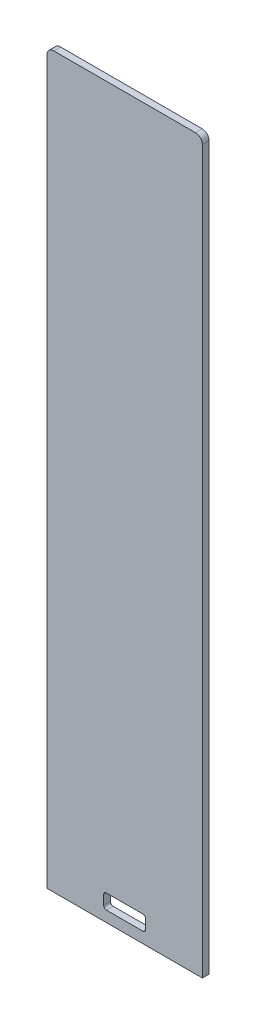
ISO-10303-21;
HEADER;
FILE_DESCRIPTION(('STEP AP214'),'2;1');
FILE_NAME('part.step','',(''),(''),'','','');
FILE_SCHEMA(('AUTOMOTIVE_DESIGN { 1 0 10303 214 1 1 1 1 }'));
ENDSEC;
DATA;
#1=APPLICATION_CONTEXT('core data for automotive mechanical design processes');
#2=APPLICATION_PROTOCOL_DEFINITION('international standard','automotive_design',2000,#1);
#3=PRODUCT_CONTEXT('',#1,'mechanical');
#4=PRODUCT('Part','Part','',(#3));
#5=PRODUCT_RELATED_PRODUCT_CATEGORY('part','',(#4));
#6=PRODUCT_DEFINITION_FORMATION('','',#4);
#7=PRODUCT_DEFINITION_CONTEXT('part definition',#1,'design');
#8=PRODUCT_DEFINITION('design','',#6,#7);
#9=PRODUCT_DEFINITION_SHAPE('','',#8);
#10=(LENGTH_UNIT() NAMED_UNIT(*) SI_UNIT(.MILLI.,.METRE.));
#11=(NAMED_UNIT(*) PLANE_ANGLE_UNIT() SI_UNIT($,.RADIAN.));
#12=(NAMED_UNIT(*) SI_UNIT($,.STERADIAN.) SOLID_ANGLE_UNIT());
#13=UNCERTAINTY_MEASURE_WITH_UNIT(LENGTH_MEASURE(1.E-05),#10,'distance_accuracy_value','');
#14=(GEOMETRIC_REPRESENTATION_CONTEXT(3) GLOBAL_UNCERTAINTY_ASSIGNED_CONTEXT((#13)) GLOBAL_UNIT_ASSIGNED_CONTEXT((#10,
#11,#12)) REPRESENTATION_CONTEXT('',''));
#15=CARTESIAN_POINT('',(0.,0.,0.));
#16=DIRECTION('',(0.,0.,1.));
#17=DIRECTION('',(1.,0.,0.));
#18=AXIS2_PLACEMENT_3D('',#15,#16,#17);
#19=CARTESIAN_POINT('',(-57.5,499.2,5.));
#20=DIRECTION('',(1.,0.,0.));
#21=DIRECTION('',(0.,1.,0.));
#22=AXIS2_PLACEMENT_3D('',#19,#20,#21);
#23=PLANE('',#22);
#24=DIRECTION('',(0.,-1.,0.));
#25=VECTOR('',#24,1.);
#26=CARTESIAN_POINT('',(-57.5,499.2,5.));
#27=LINE('',#26,#25);
#28=CARTESIAN_POINT('',(-57.5,534.2,5.));
#29=VERTEX_POINT('',#28);
#30=CARTESIAN_POINT('',(-57.5000000000001,0.,5.));
#31=VERTEX_POINT('',#30);
#32=EDGE_CURVE('E142',#29,#31,#27,.T.);
#33=ORIENTED_EDGE('',*,*,#32,.F.);
#34=DIRECTION('',(0.,0.,1.));
#35=VECTOR('',#34,1.);
#36=CARTESIAN_POINT('',(-57.5,534.2,0.));
#37=LINE('',#36,#35);
#38=CARTESIAN_POINT('',(-57.5,534.2,0.));
#39=VERTEX_POINT('',#38);
#40=EDGE_CURVE('E63',#29,#39,#37,.F.);
#41=ORIENTED_EDGE('',*,*,#40,.T.);
#42=DIRECTION('',(0.,-1.,0.));
#43=VECTOR('',#42,1.);
#44=CARTESIAN_POINT('',(-57.5,499.2,0.));
#45=LINE('',#44,#43);
#46=CARTESIAN_POINT('',(-57.5000000000001,0.,0.));
#47=VERTEX_POINT('',#46);
#48=EDGE_CURVE('E164',#39,#47,#45,.T.);
#49=ORIENTED_EDGE('',*,*,#48,.T.);
#50=DIRECTION('',(0.,0.,-1.));
#51=VECTOR('',#50,1.);
#52=CARTESIAN_POINT('',(-57.5000000000001,0.,5.));
#53=LINE('',#52,#51);
#54=EDGE_CURVE('E157',#31,#47,#53,.T.);
#55=ORIENTED_EDGE('',*,*,#54,.F.);
#56=EDGE_LOOP('',(#33,#41,#49,#55));
#57=FACE_BOUND('',#56,.T.);
#58=ADVANCED_FACE('F39',(#57),#23,.F.);
#59=CARTESIAN_POINT('',(-57.5000000000001,0.,5.));
#60=DIRECTION('',(0.,1.,0.));
#61=DIRECTION('',(0.,0.,1.));
#62=AXIS2_PLACEMENT_3D('',#59,#60,#61);
#63=PLANE('',#62);
#64=DIRECTION('',(1.,0.,0.));
#65=VECTOR('',#64,1.);
#66=CARTESIAN_POINT('',(-57.5000000000001,0.,0.));
#67=LINE('',#66,#65);
#68=CARTESIAN_POINT('',(57.5000000000001,0.,0.));
#69=VERTEX_POINT('',#68);
#70=EDGE_CURVE('E334',#47,#69,#67,.T.);
#71=ORIENTED_EDGE('',*,*,#70,.T.);
#72=DIRECTION('',(0.,0.,-1.));
#73=VECTOR('',#72,1.);
#74=CARTESIAN_POINT('',(57.5000000000001,0.,5.));
#75=LINE('',#74,#73);
#76=CARTESIAN_POINT('',(57.5000000000001,0.,5.));
#77=VERTEX_POINT('',#76);
#78=EDGE_CURVE('E159',#77,#69,#75,.T.);
#79=ORIENTED_EDGE('',*,*,#78,.F.);
#80=DIRECTION('',(1.,0.,0.));
#81=VECTOR('',#80,1.);
#82=CARTESIAN_POINT('',(-57.5000000000001,0.,5.));
#83=LINE('',#82,#81);
#84=EDGE_CURVE('E147',#31,#77,#83,.T.);
#85=ORIENTED_EDGE('',*,*,#84,.F.);
#86=ORIENTED_EDGE('',*,*,#54,.T.);
#87=EDGE_LOOP('',(#71,#79,#85,#86));
#88=FACE_BOUND('',#87,.T.);
#89=ADVANCED_FACE('F156',(#88),#63,.F.);
#90=CARTESIAN_POINT('',(57.5,499.2,5.));
#91=DIRECTION('',(-1.,0.,0.));
#92=DIRECTION('',(0.,-1.,0.));
#93=AXIS2_PLACEMENT_3D('',#90,#91,#92);
#94=PLANE('',#93);
#95=DIRECTION('',(0.,1.,0.));
#96=VECTOR('',#95,1.);
#97=CARTESIAN_POINT('',(57.5,499.2,0.));
#98=LINE('',#97,#96);
#99=CARTESIAN_POINT('',(57.5,534.2,0.));
#100=VERTEX_POINT('',#99);
#101=EDGE_CURVE('E152',#69,#100,#98,.T.);
#102=ORIENTED_EDGE('',*,*,#101,.T.);
#103=DIRECTION('',(0.,0.,1.));
#104=VECTOR('',#103,1.);
#105=CARTESIAN_POINT('',(57.5,534.2,5.));
#106=LINE('',#105,#104);
#107=CARTESIAN_POINT('',(57.5,534.2,5.));
#108=VERTEX_POINT('',#107);
#109=EDGE_CURVE('E11',#100,#108,#106,.T.);
#110=ORIENTED_EDGE('',*,*,#109,.T.);
#111=DIRECTION('',(0.,1.,0.));
#112=VECTOR('',#111,1.);
#113=CARTESIAN_POINT('',(57.5,499.2,5.));
#114=LINE('',#113,#112);
#115=EDGE_CURVE('E162',#77,#108,#114,.T.);
#116=ORIENTED_EDGE('',*,*,#115,.F.);
#117=ORIENTED_EDGE('',*,*,#78,.T.);
#118=EDGE_LOOP('',(#102,#110,#116,#117));
#119=FACE_BOUND('',#118,.T.);
#120=ADVANCED_FACE('F269',(#119),#94,.F.);
#121=CARTESIAN_POINT('',(0.,0.,5.));
#122=DIRECTION('',(0.,0.,1.));
#123=DIRECTION('',(1.,0.,0.));
#124=AXIS2_PLACEMENT_3D('',#121,#122,#123);
#125=PLANE('',#124);
#126=DIRECTION('',(0.,-1.,0.));
#127=VECTOR('',#126,1.);
#128=CARTESIAN_POINT('',(-15.5,19.,5.));
#129=LINE('',#128,#127);
#130=CARTESIAN_POINT('',(-15.5,17.,5.));
#131=VERTEX_POINT('',#130);
#132=CARTESIAN_POINT('',(-15.5,10.,5.));
#133=VERTEX_POINT('',#132);
#134=EDGE_CURVE('E306',#131,#133,#129,.T.);
#135=ORIENTED_EDGE('',*,*,#134,.F.);
#136=CARTESIAN_POINT('',(-13.5,17.,5.));
#137=DIRECTION('',(0.,0.,1.));
#138=DIRECTION('',(1.,0.,0.));
#139=AXIS2_PLACEMENT_3D('',#136,#137,#138);
#140=CIRCLE('',#139,2.);
#141=CARTESIAN_POINT('',(-13.5,19.,5.));
#142=VERTEX_POINT('',#141);
#143=EDGE_CURVE('E218',#131,#142,#140,.F.);
#144=ORIENTED_EDGE('',*,*,#143,.T.);
#145=DIRECTION('',(-1.,0.,0.));
#146=VECTOR('',#145,1.);
#147=CARTESIAN_POINT('',(-15.5,19.,5.));
#148=LINE('',#147,#146);
#149=CARTESIAN_POINT('',(13.5,19.,5.));
#150=VERTEX_POINT('',#149);
#151=EDGE_CURVE('E322',#150,#142,#148,.T.);
#152=ORIENTED_EDGE('',*,*,#151,.F.);
#153=CARTESIAN_POINT('',(13.5,17.,5.));
#154=DIRECTION('',(0.,0.,1.));
#155=DIRECTION('',(1.,0.,0.));
#156=AXIS2_PLACEMENT_3D('',#153,#154,#155);
#157=CIRCLE('',#156,2.);
#158=CARTESIAN_POINT('',(15.5,17.,5.));
#159=VERTEX_POINT('',#158);
#160=EDGE_CURVE('E206',#150,#159,#157,.F.);
#161=ORIENTED_EDGE('',*,*,#160,.T.);
#162=DIRECTION('',(0.,1.,0.));
#163=VECTOR('',#162,1.);
#164=CARTESIAN_POINT('',(15.5,19.,5.));
#165=LINE('',#164,#163);
#166=CARTESIAN_POINT('',(15.5,10.,5.));
#167=VERTEX_POINT('',#166);
#168=EDGE_CURVE('E318',#167,#159,#165,.T.);
#169=ORIENTED_EDGE('',*,*,#168,.F.);
#170=CARTESIAN_POINT('',(13.5,10.,5.));
#171=DIRECTION('',(0.,0.,1.));
#172=DIRECTION('',(1.,0.,0.));
#173=AXIS2_PLACEMENT_3D('',#170,#171,#172);
#174=CIRCLE('',#173,2.);
#175=CARTESIAN_POINT('',(13.5,8.,5.));
#176=VERTEX_POINT('',#175);
#177=EDGE_CURVE('E200',#167,#176,#174,.F.);
#178=ORIENTED_EDGE('',*,*,#177,.T.);
#179=DIRECTION('',(1.,0.,0.));
#180=VECTOR('',#179,1.);
#181=CARTESIAN_POINT('',(-15.5,8.,5.));
#182=LINE('',#181,#180);
#183=CARTESIAN_POINT('',(-13.5,8.,5.));
#184=VERTEX_POINT('',#183);
#185=EDGE_CURVE('E310',#184,#176,#182,.T.);
#186=ORIENTED_EDGE('',*,*,#185,.F.);
#187=CARTESIAN_POINT('',(-13.5,10.,5.));
#188=DIRECTION('',(0.,0.,1.));
#189=DIRECTION('',(1.,0.,0.));
#190=AXIS2_PLACEMENT_3D('',#187,#188,#189);
#191=CIRCLE('',#190,2.);
#192=EDGE_CURVE('E212',#184,#133,#191,.F.);
#193=ORIENTED_EDGE('',*,*,#192,.T.);
#194=EDGE_LOOP('',(#135,#144,#152,#161,#169,#178,#186,#193));
#195=FACE_BOUND('',#194,.T.);
#196=DIRECTION('',(-1.,0.,0.));
#197=VECTOR('',#196,1.);
#198=CARTESIAN_POINT('',(-57.5,539.2,5.));
#199=LINE('',#198,#197);
#200=CARTESIAN_POINT('',(52.5,539.2,5.));
#201=VERTEX_POINT('',#200);
#202=CARTESIAN_POINT('',(-52.5,539.2,5.));
#203=VERTEX_POINT('',#202);
#204=EDGE_CURVE('E252',#201,#203,#199,.T.);
#205=ORIENTED_EDGE('',*,*,#204,.T.);
#206=CARTESIAN_POINT('',(-52.5,534.2,5.));
#207=DIRECTION('',(0.,0.,1.));
#208=DIRECTION('',(1.,0.,0.));
#209=AXIS2_PLACEMENT_3D('',#206,#207,#208);
#210=CIRCLE('',#209,5.);
#211=EDGE_CURVE('E149',#203,#29,#210,.T.);
#212=ORIENTED_EDGE('',*,*,#211,.T.);
#213=ORIENTED_EDGE('',*,*,#32,.T.);
#214=ORIENTED_EDGE('',*,*,#84,.T.);
#215=ORIENTED_EDGE('',*,*,#115,.T.);
#216=CARTESIAN_POINT('',(52.5,534.2,5.));
#217=DIRECTION('',(0.,0.,1.));
#218=DIRECTION('',(1.,0.,0.));
#219=AXIS2_PLACEMENT_3D('',#216,#217,#218);
#220=CIRCLE('',#219,5.);
#221=EDGE_CURVE('E231',#108,#201,#220,.T.);
#222=ORIENTED_EDGE('',*,*,#221,.T.);
#223=EDGE_LOOP('',(#205,#212,#213,#214,#215,#222));
#224=FACE_BOUND('',#223,.T.);
#225=ADVANCED_FACE('F145',(#195,#224),#125,.T.);
#226=CARTESIAN_POINT('',(0.,0.,0.));
#227=DIRECTION('',(0.,0.,1.));
#228=DIRECTION('',(1.,0.,0.));
#229=AXIS2_PLACEMENT_3D('',#226,#227,#228);
#230=PLANE('',#229);
#231=DIRECTION('',(1.,0.,0.));
#232=VECTOR('',#231,1.);
#233=CARTESIAN_POINT('',(-15.5,19.,0.));
#234=LINE('',#233,#232);
#235=CARTESIAN_POINT('',(-13.5,19.,0.));
#236=VERTEX_POINT('',#235);
#237=CARTESIAN_POINT('',(13.5,19.,0.));
#238=VERTEX_POINT('',#237);
#239=EDGE_CURVE('E299',#236,#238,#234,.T.);
#240=ORIENTED_EDGE('',*,*,#239,.F.);
#241=CARTESIAN_POINT('',(-13.5,17.,0.));
#242=DIRECTION('',(0.,0.,1.));
#243=DIRECTION('',(1.,0.,0.));
#244=AXIS2_PLACEMENT_3D('',#241,#242,#243);
#245=CIRCLE('',#244,2.);
#246=CARTESIAN_POINT('',(-15.5,17.,0.));
#247=VERTEX_POINT('',#246);
#248=EDGE_CURVE('E221',#236,#247,#245,.T.);
#249=ORIENTED_EDGE('',*,*,#248,.T.);
#250=DIRECTION('',(0.,1.,0.));
#251=VECTOR('',#250,1.);
#252=CARTESIAN_POINT('',(-15.5,19.,0.));
#253=LINE('',#252,#251);
#254=CARTESIAN_POINT('',(-15.5,10.,0.));
#255=VERTEX_POINT('',#254);
#256=EDGE_CURVE('E296',#255,#247,#253,.T.);
#257=ORIENTED_EDGE('',*,*,#256,.F.);
#258=CARTESIAN_POINT('',(-13.5,10.,0.));
#259=DIRECTION('',(0.,0.,1.));
#260=DIRECTION('',(1.,0.,0.));
#261=AXIS2_PLACEMENT_3D('',#258,#259,#260);
#262=CIRCLE('',#261,2.);
#263=CARTESIAN_POINT('',(-13.5,8.,0.));
#264=VERTEX_POINT('',#263);
#265=EDGE_CURVE('E215',#255,#264,#262,.T.);
#266=ORIENTED_EDGE('',*,*,#265,.T.);
#267=DIRECTION('',(-1.,0.,0.));
#268=VECTOR('',#267,1.);
#269=CARTESIAN_POINT('',(-15.5,8.,0.));
#270=LINE('',#269,#268);
#271=CARTESIAN_POINT('',(13.5,8.,0.));
#272=VERTEX_POINT('',#271);
#273=EDGE_CURVE('E326',#272,#264,#270,.T.);
#274=ORIENTED_EDGE('',*,*,#273,.F.);
#275=CARTESIAN_POINT('',(13.5,10.,0.));
#276=DIRECTION('',(0.,0.,1.));
#277=DIRECTION('',(1.,0.,0.));
#278=AXIS2_PLACEMENT_3D('',#275,#276,#277);
#279=CIRCLE('',#278,2.);
#280=CARTESIAN_POINT('',(15.5,10.,0.));
#281=VERTEX_POINT('',#280);
#282=EDGE_CURVE('E203',#272,#281,#279,.T.);
#283=ORIENTED_EDGE('',*,*,#282,.T.);
#284=DIRECTION('',(0.,-1.,0.));
#285=VECTOR('',#284,1.);
#286=CARTESIAN_POINT('',(15.5,19.,0.));
#287=LINE('',#286,#285);
#288=CARTESIAN_POINT('',(15.5,17.,0.));
#289=VERTEX_POINT('',#288);
#290=EDGE_CURVE('E251',#289,#281,#287,.T.);
#291=ORIENTED_EDGE('',*,*,#290,.F.);
#292=CARTESIAN_POINT('',(13.5,17.,0.));
#293=DIRECTION('',(0.,0.,1.));
#294=DIRECTION('',(1.,0.,0.));
#295=AXIS2_PLACEMENT_3D('',#292,#293,#294);
#296=CIRCLE('',#295,2.);
#297=EDGE_CURVE('E209',#289,#238,#296,.T.);
#298=ORIENTED_EDGE('',*,*,#297,.T.);
#299=EDGE_LOOP('',(#240,#249,#257,#266,#274,#283,#291,#298));
#300=FACE_BOUND('',#299,.T.);
#301=ORIENTED_EDGE('',*,*,#48,.F.);
#302=CARTESIAN_POINT('',(-52.5,534.2,0.));
#303=DIRECTION('',(0.,0.,1.));
#304=DIRECTION('',(1.,0.,0.));
#305=AXIS2_PLACEMENT_3D('',#302,#303,#304);
#306=CIRCLE('',#305,5.);
#307=CARTESIAN_POINT('',(-52.5,539.2,0.));
#308=VERTEX_POINT('',#307);
#309=EDGE_CURVE('E48',#39,#308,#306,.F.);
#310=ORIENTED_EDGE('',*,*,#309,.T.);
#311=DIRECTION('',(-1.,0.,0.));
#312=VECTOR('',#311,1.);
#313=CARTESIAN_POINT('',(-57.5,539.2,0.));
#314=LINE('',#313,#312);
#315=CARTESIAN_POINT('',(52.5,539.2,0.));
#316=VERTEX_POINT('',#315);
#317=EDGE_CURVE('E243',#316,#308,#314,.T.);
#318=ORIENTED_EDGE('',*,*,#317,.F.);
#319=CARTESIAN_POINT('',(52.5,534.2,0.));
#320=DIRECTION('',(0.,0.,1.));
#321=DIRECTION('',(1.,0.,0.));
#322=AXIS2_PLACEMENT_3D('',#319,#320,#321);
#323=CIRCLE('',#322,5.);
#324=EDGE_CURVE('E55',#316,#100,#323,.F.);
#325=ORIENTED_EDGE('',*,*,#324,.T.);
#326=ORIENTED_EDGE('',*,*,#101,.F.);
#327=ORIENTED_EDGE('',*,*,#70,.F.);
#328=EDGE_LOOP('',(#301,#310,#318,#325,#326,#327));
#329=FACE_BOUND('',#328,.T.);
#330=ADVANCED_FACE('F242',(#300,#329),#230,.F.);
#331=CARTESIAN_POINT('',(-15.5,19.,-0.00100000000000013));
#332=DIRECTION('',(-1.,0.,0.));
#333=DIRECTION('',(0.,-1.,0.));
#334=AXIS2_PLACEMENT_3D('',#331,#332,#333);
#335=PLANE('',#334);
#336=ORIENTED_EDGE('',*,*,#134,.T.);
#337=DIRECTION('',(0.,0.,1.));
#338=VECTOR('',#337,1.);
#339=CARTESIAN_POINT('',(-15.5,10.,0.));
#340=LINE('',#339,#338);
#341=EDGE_CURVE('E197',#133,#255,#340,.F.);
#342=ORIENTED_EDGE('',*,*,#341,.T.);
#343=ORIENTED_EDGE('',*,*,#256,.T.);
#344=DIRECTION('',(0.,0.,1.));
#345=VECTOR('',#344,1.);
#346=CARTESIAN_POINT('',(-15.5,17.,5.));
#347=LINE('',#346,#345);
#348=EDGE_CURVE('E193',#247,#131,#347,.T.);
#349=ORIENTED_EDGE('',*,*,#348,.T.);
#350=EDGE_LOOP('',(#336,#342,#343,#349));
#351=FACE_BOUND('',#350,.T.);
#352=ADVANCED_FACE('F302',(#351),#335,.F.);
#353=CARTESIAN_POINT('',(-15.5,19.,-0.00100000000000013));
#354=DIRECTION('',(0.,1.,0.));
#355=DIRECTION('',(0.,0.,1.));
#356=AXIS2_PLACEMENT_3D('',#353,#354,#355);
#357=PLANE('',#356);
#358=ORIENTED_EDGE('',*,*,#239,.T.);
#359=DIRECTION('',(0.,0.,1.));
#360=VECTOR('',#359,1.);
#361=CARTESIAN_POINT('',(13.5,19.,5.));
#362=LINE('',#361,#360);
#363=EDGE_CURVE('E189',#238,#150,#362,.T.);
#364=ORIENTED_EDGE('',*,*,#363,.T.);
#365=ORIENTED_EDGE('',*,*,#151,.T.);
#366=DIRECTION('',(0.,0.,1.));
#367=VECTOR('',#366,1.);
#368=CARTESIAN_POINT('',(-13.5,19.,0.));
#369=LINE('',#368,#367);
#370=EDGE_CURVE('E186',#142,#236,#369,.F.);
#371=ORIENTED_EDGE('',*,*,#370,.T.);
#372=EDGE_LOOP('',(#358,#364,#365,#371));
#373=FACE_BOUND('',#372,.T.);
#374=ADVANCED_FACE('F359',(#373),#357,.F.);
#375=CARTESIAN_POINT('',(15.5,19.,-0.00100000000000013));
#376=DIRECTION('',(1.,0.,0.));
#377=DIRECTION('',(0.,1.,0.));
#378=AXIS2_PLACEMENT_3D('',#375,#376,#377);
#379=PLANE('',#378);
#380=ORIENTED_EDGE('',*,*,#290,.T.);
#381=DIRECTION('',(0.,0.,1.));
#382=VECTOR('',#381,1.);
#383=CARTESIAN_POINT('',(15.5,10.,5.));
#384=LINE('',#383,#382);
#385=EDGE_CURVE('E171',#281,#167,#384,.T.);
#386=ORIENTED_EDGE('',*,*,#385,.T.);
#387=ORIENTED_EDGE('',*,*,#168,.T.);
#388=DIRECTION('',(0.,0.,1.));
#389=VECTOR('',#388,1.);
#390=CARTESIAN_POINT('',(15.5,17.,0.));
#391=LINE('',#390,#389);
#392=EDGE_CURVE('E167',#159,#289,#391,.F.);
#393=ORIENTED_EDGE('',*,*,#392,.T.);
#394=EDGE_LOOP('',(#380,#386,#387,#393));
#395=FACE_BOUND('',#394,.T.);
#396=ADVANCED_FACE('F346',(#395),#379,.F.);
#397=CARTESIAN_POINT('',(-15.5,8.,-0.00100000000000013));
#398=DIRECTION('',(0.,-1.,0.));
#399=DIRECTION('',(0.,0.,-1.));
#400=AXIS2_PLACEMENT_3D('',#397,#398,#399);
#401=PLANE('',#400);
#402=ORIENTED_EDGE('',*,*,#185,.T.);
#403=DIRECTION('',(0.,0.,1.));
#404=VECTOR('',#403,1.);
#405=CARTESIAN_POINT('',(13.5,8.,0.));
#406=LINE('',#405,#404);
#407=EDGE_CURVE('E183',#176,#272,#406,.F.);
#408=ORIENTED_EDGE('',*,*,#407,.T.);
#409=ORIENTED_EDGE('',*,*,#273,.T.);
#410=DIRECTION('',(0.,0.,1.));
#411=VECTOR('',#410,1.);
#412=CARTESIAN_POINT('',(-13.5,8.,5.));
#413=LINE('',#412,#411);
#414=EDGE_CURVE('E179',#264,#184,#413,.T.);
#415=ORIENTED_EDGE('',*,*,#414,.T.);
#416=EDGE_LOOP('',(#402,#408,#409,#415));
#417=FACE_BOUND('',#416,.T.);
#418=ADVANCED_FACE('F277',(#417),#401,.F.);
#419=CARTESIAN_POINT('',(13.5,10.,-0.00100000000000013));
#420=DIRECTION('',(0.,0.,-1.));
#421=DIRECTION('',(-1.,0.,0.));
#422=AXIS2_PLACEMENT_3D('',#419,#420,#421);
#423=CYLINDRICAL_SURFACE('',#422,2.);
#424=ORIENTED_EDGE('',*,*,#282,.F.);
#425=ORIENTED_EDGE('',*,*,#407,.F.);
#426=ORIENTED_EDGE('',*,*,#177,.F.);
#427=ORIENTED_EDGE('',*,*,#385,.F.);
#428=EDGE_LOOP('',(#424,#425,#426,#427));
#429=FACE_BOUND('',#428,.T.);
#430=ADVANCED_FACE('F273',(#429),#423,.F.);
#431=CARTESIAN_POINT('',(13.5,17.,-0.00100000000000013));
#432=DIRECTION('',(0.,0.,-1.));
#433=DIRECTION('',(-1.,0.,0.));
#434=AXIS2_PLACEMENT_3D('',#431,#432,#433);
#435=CYLINDRICAL_SURFACE('',#434,2.);
#436=ORIENTED_EDGE('',*,*,#297,.F.);
#437=ORIENTED_EDGE('',*,*,#392,.F.);
#438=ORIENTED_EDGE('',*,*,#160,.F.);
#439=ORIENTED_EDGE('',*,*,#363,.F.);
#440=EDGE_LOOP('',(#436,#437,#438,#439));
#441=FACE_BOUND('',#440,.T.);
#442=ADVANCED_FACE('F276',(#441),#435,.F.);
#443=CARTESIAN_POINT('',(-13.5,10.,-0.00100000000000013));
#444=DIRECTION('',(0.,0.,-1.));
#445=DIRECTION('',(-1.,0.,0.));
#446=AXIS2_PLACEMENT_3D('',#443,#444,#445);
#447=CYLINDRICAL_SURFACE('',#446,2.);
#448=ORIENTED_EDGE('',*,*,#265,.F.);
#449=ORIENTED_EDGE('',*,*,#341,.F.);
#450=ORIENTED_EDGE('',*,*,#192,.F.);
#451=ORIENTED_EDGE('',*,*,#414,.F.);
#452=EDGE_LOOP('',(#448,#449,#450,#451));
#453=FACE_BOUND('',#452,.T.);
#454=ADVANCED_FACE('F281',(#453),#447,.F.);
#455=CARTESIAN_POINT('',(-13.5,17.,-0.00100000000000013));
#456=DIRECTION('',(0.,0.,-1.));
#457=DIRECTION('',(-1.,0.,0.));
#458=AXIS2_PLACEMENT_3D('',#455,#456,#457);
#459=CYLINDRICAL_SURFACE('',#458,2.);
#460=ORIENTED_EDGE('',*,*,#248,.F.);
#461=ORIENTED_EDGE('',*,*,#370,.F.);
#462=ORIENTED_EDGE('',*,*,#143,.F.);
#463=ORIENTED_EDGE('',*,*,#348,.F.);
#464=EDGE_LOOP('',(#460,#461,#462,#463));
#465=FACE_BOUND('',#464,.T.);
#466=ADVANCED_FACE('F261',(#465),#459,.F.);
#467=CARTESIAN_POINT('',(-57.5,539.2,0.));
#468=DIRECTION('',(0.,1.,0.));
#469=DIRECTION('',(0.,0.,1.));
#470=AXIS2_PLACEMENT_3D('',#467,#468,#469);
#471=PLANE('',#470);
#472=ORIENTED_EDGE('',*,*,#317,.T.);
#473=DIRECTION('',(0.,0.,1.));
#474=VECTOR('',#473,1.);
#475=CARTESIAN_POINT('',(-52.5,539.2,5.));
#476=LINE('',#475,#474);
#477=EDGE_CURVE('E227',#308,#203,#476,.T.);
#478=ORIENTED_EDGE('',*,*,#477,.T.);
#479=ORIENTED_EDGE('',*,*,#204,.F.);
#480=DIRECTION('',(0.,0.,1.));
#481=VECTOR('',#480,1.);
#482=CARTESIAN_POINT('',(52.5,539.2,0.));
#483=LINE('',#482,#481);
#484=EDGE_CURVE('E224',#201,#316,#483,.F.);
#485=ORIENTED_EDGE('',*,*,#484,.T.);
#486=EDGE_LOOP('',(#472,#478,#479,#485));
#487=FACE_BOUND('',#486,.T.);
#488=ADVANCED_FACE('F247',(#487),#471,.T.);
#489=CARTESIAN_POINT('',(-52.5,534.2,0.));
#490=DIRECTION('',(0.,0.,-1.));
#491=DIRECTION('',(-1.,0.,0.));
#492=AXIS2_PLACEMENT_3D('',#489,#490,#491);
#493=CYLINDRICAL_SURFACE('',#492,5.);
#494=ORIENTED_EDGE('',*,*,#309,.F.);
#495=ORIENTED_EDGE('',*,*,#40,.F.);
#496=ORIENTED_EDGE('',*,*,#211,.F.);
#497=ORIENTED_EDGE('',*,*,#477,.F.);
#498=EDGE_LOOP('',(#494,#495,#496,#497));
#499=FACE_BOUND('',#498,.T.);
#500=ADVANCED_FACE('F254',(#499),#493,.T.);
#501=CARTESIAN_POINT('',(52.5,534.2,5.));
#502=DIRECTION('',(0.,0.,-1.));
#503=DIRECTION('',(-1.,0.,0.));
#504=AXIS2_PLACEMENT_3D('',#501,#502,#503);
#505=CYLINDRICAL_SURFACE('',#504,5.);
#506=ORIENTED_EDGE('',*,*,#324,.F.);
#507=ORIENTED_EDGE('',*,*,#484,.F.);
#508=ORIENTED_EDGE('',*,*,#221,.F.);
#509=ORIENTED_EDGE('',*,*,#109,.F.);
#510=EDGE_LOOP('',(#506,#507,#508,#509));
#511=FACE_BOUND('',#510,.T.);
#512=ADVANCED_FACE('F41',(#511),#505,.T.);
#513=CLOSED_SHELL('',(#58,#89,#120,#225,#330,#352,#374,#396,#418,#430,#442,#454,#466,#488,#500,#512));
#514=MANIFOLD_SOLID_BREP('B2',#513);
#515=ADVANCED_BREP_SHAPE_REPRESENTATION('',(#18,#514),#14);
#516=SHAPE_DEFINITION_REPRESENTATION(#9,#515);
ENDSEC;
END-ISO-10303-21;
